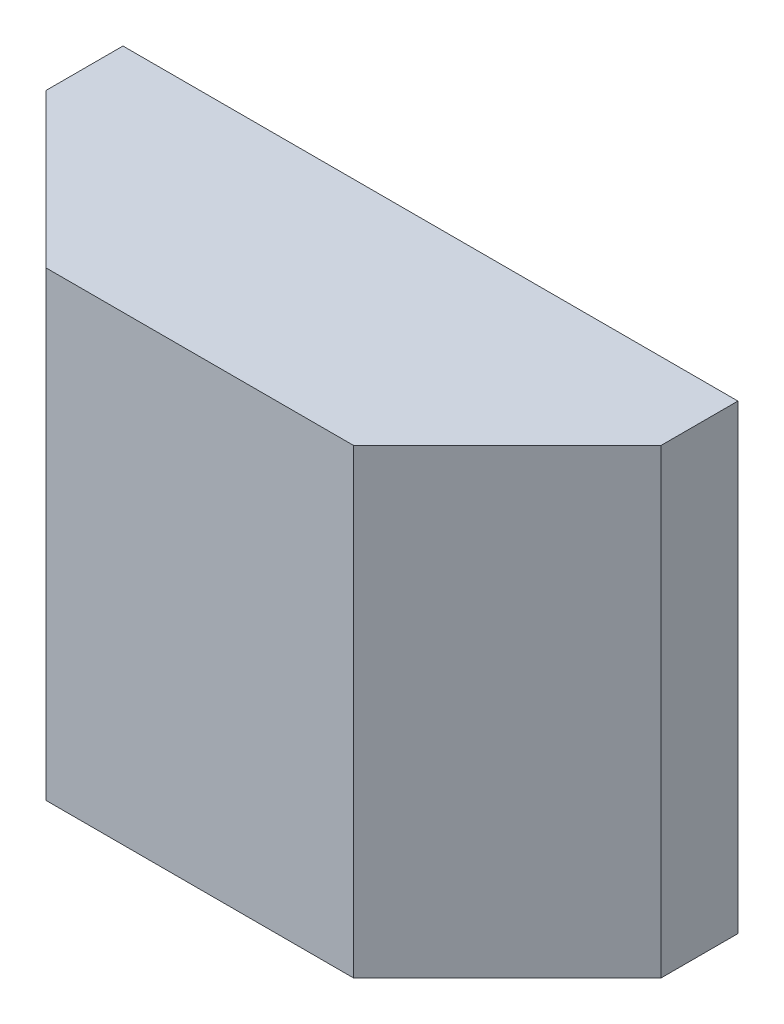
ISO-10303-21;
HEADER;
FILE_DESCRIPTION(('STEP AP214'),'2;1');
FILE_NAME('part.step','',(''),(''),'','','');
FILE_SCHEMA(('AUTOMOTIVE_DESIGN { 1 0 10303 214 1 1 1 1 }'));
ENDSEC;
DATA;
#1=APPLICATION_CONTEXT('core data for automotive mechanical design processes');
#2=APPLICATION_PROTOCOL_DEFINITION('international standard','automotive_design',2000,#1);
#3=PRODUCT_CONTEXT('',#1,'mechanical');
#4=PRODUCT('Part','Part','',(#3));
#5=PRODUCT_RELATED_PRODUCT_CATEGORY('part','',(#4));
#6=PRODUCT_DEFINITION_FORMATION('','',#4);
#7=PRODUCT_DEFINITION_CONTEXT('part definition',#1,'design');
#8=PRODUCT_DEFINITION('design','',#6,#7);
#9=PRODUCT_DEFINITION_SHAPE('','',#8);
#10=(LENGTH_UNIT() NAMED_UNIT(*) SI_UNIT(.MILLI.,.METRE.));
#11=(NAMED_UNIT(*) PLANE_ANGLE_UNIT() SI_UNIT($,.RADIAN.));
#12=(NAMED_UNIT(*) SI_UNIT($,.STERADIAN.) SOLID_ANGLE_UNIT());
#13=UNCERTAINTY_MEASURE_WITH_UNIT(LENGTH_MEASURE(1.E-05),#10,'distance_accuracy_value','');
#14=(GEOMETRIC_REPRESENTATION_CONTEXT(3) GLOBAL_UNCERTAINTY_ASSIGNED_CONTEXT((#13)) GLOBAL_UNIT_ASSIGNED_CONTEXT((#10,
#11,#12)) REPRESENTATION_CONTEXT('',''));
#15=CARTESIAN_POINT('',(0.,0.,0.));
#16=DIRECTION('',(0.,0.,1.));
#17=DIRECTION('',(1.,0.,0.));
#18=AXIS2_PLACEMENT_3D('',#15,#16,#17);
#19=CARTESIAN_POINT('',(2.,-1.5,1.5));
#20=DIRECTION('',(-1.,0.,0.));
#21=DIRECTION('',(0.,0.,1.));
#22=AXIS2_PLACEMENT_3D('',#19,#20,#21);
#23=PLANE('',#22);
#24=DIRECTION('',(0.,0.,-1.));
#25=VECTOR('',#24,1.);
#26=CARTESIAN_POINT('',(2.,1.5,1.5));
#27=LINE('',#26,#25);
#28=CARTESIAN_POINT('',(2.,1.5,0.499999999999996));
#29=VERTEX_POINT('',#28);
#30=CARTESIAN_POINT('',(2.,1.5,0.));
#31=VERTEX_POINT('',#30);
#32=EDGE_CURVE('E91',#29,#31,#27,.T.);
#33=ORIENTED_EDGE('',*,*,#32,.F.);
#34=DIRECTION('',(0.,-1.,0.));
#35=VECTOR('',#34,1.);
#36=CARTESIAN_POINT('',(2.,-1.5,0.499999999999996));
#37=LINE('',#36,#35);
#38=CARTESIAN_POINT('',(2.,-1.5,0.499999999999996));
#39=VERTEX_POINT('',#38);
#40=EDGE_CURVE('E62',#29,#39,#37,.T.);
#41=ORIENTED_EDGE('',*,*,#40,.T.);
#42=DIRECTION('',(0.,0.,-1.));
#43=VECTOR('',#42,1.);
#44=CARTESIAN_POINT('',(2.,-1.5,1.5));
#45=LINE('',#44,#43);
#46=CARTESIAN_POINT('',(2.,-1.5,0.));
#47=VERTEX_POINT('',#46);
#48=EDGE_CURVE('E111',#39,#47,#45,.T.);
#49=ORIENTED_EDGE('',*,*,#48,.T.);
#50=DIRECTION('',(0.,1.,0.));
#51=VECTOR('',#50,1.);
#52=CARTESIAN_POINT('',(2.,-1.5,0.));
#53=LINE('',#52,#51);
#54=EDGE_CURVE('E107',#47,#31,#53,.T.);
#55=ORIENTED_EDGE('',*,*,#54,.T.);
#56=EDGE_LOOP('',(#33,#41,#49,#55));
#57=FACE_BOUND('',#56,.T.);
#58=ADVANCED_FACE('F38',(#57),#23,.F.);
#59=CARTESIAN_POINT('',(-2.,1.5,1.5));
#60=DIRECTION('',(0.,-1.,0.));
#61=DIRECTION('',(0.,0.,-1.));
#62=AXIS2_PLACEMENT_3D('',#59,#60,#61);
#63=PLANE('',#62);
#64=DIRECTION('',(-1.,0.,0.));
#65=VECTOR('',#64,1.);
#66=CARTESIAN_POINT('',(-2.,1.5,1.5));
#67=LINE('',#66,#65);
#68=CARTESIAN_POINT('',(1.,1.5,1.5));
#69=VERTEX_POINT('',#68);
#70=CARTESIAN_POINT('',(-1.,1.5,1.5));
#71=VERTEX_POINT('',#70);
#72=EDGE_CURVE('E121',#69,#71,#67,.T.);
#73=ORIENTED_EDGE('',*,*,#72,.F.);
#74=DIRECTION('',(-0.707106781186546,0.,0.707106781186549));
#75=VECTOR('',#74,1.);
#76=CARTESIAN_POINT('',(1.,1.5,1.5));
#77=LINE('',#76,#75);
#78=EDGE_CURVE('E98',#69,#29,#77,.F.);
#79=ORIENTED_EDGE('',*,*,#78,.T.);
#80=ORIENTED_EDGE('',*,*,#32,.T.);
#81=DIRECTION('',(-1.,0.,0.));
#82=VECTOR('',#81,1.);
#83=CARTESIAN_POINT('',(-2.,1.5,0.));
#84=LINE('',#83,#82);
#85=CARTESIAN_POINT('',(-2.,1.5,0.));
#86=VERTEX_POINT('',#85);
#87=EDGE_CURVE('E96',#31,#86,#84,.T.);
#88=ORIENTED_EDGE('',*,*,#87,.T.);
#89=DIRECTION('',(0.,0.,-1.));
#90=VECTOR('',#89,1.);
#91=CARTESIAN_POINT('',(-2.,1.5,1.5));
#92=LINE('',#91,#90);
#93=CARTESIAN_POINT('',(-2.,1.5,0.499999999999996));
#94=VERTEX_POINT('',#93);
#95=EDGE_CURVE('E101',#94,#86,#92,.T.);
#96=ORIENTED_EDGE('',*,*,#95,.F.);
#97=DIRECTION('',(-0.707106781186546,0.,-0.707106781186549));
#98=VECTOR('',#97,1.);
#99=CARTESIAN_POINT('',(-1.,1.5,1.5));
#100=LINE('',#99,#98);
#101=EDGE_CURVE('E131',#94,#71,#100,.F.);
#102=ORIENTED_EDGE('',*,*,#101,.T.);
#103=EDGE_LOOP('',(#73,#79,#80,#88,#96,#102));
#104=FACE_BOUND('',#103,.T.);
#105=ADVANCED_FACE('F94',(#104),#63,.F.);
#106=CARTESIAN_POINT('',(-2.,-1.5,1.5));
#107=DIRECTION('',(1.,0.,0.));
#108=DIRECTION('',(0.,0.,-1.));
#109=AXIS2_PLACEMENT_3D('',#106,#107,#108);
#110=PLANE('',#109);
#111=DIRECTION('',(0.,0.,-1.));
#112=VECTOR('',#111,1.);
#113=CARTESIAN_POINT('',(-2.,-1.5,1.5));
#114=LINE('',#113,#112);
#115=CARTESIAN_POINT('',(-2.,-1.5,0.499999999999996));
#116=VERTEX_POINT('',#115);
#117=CARTESIAN_POINT('',(-2.,-1.5,0.));
#118=VERTEX_POINT('',#117);
#119=EDGE_CURVE('E123',#116,#118,#114,.T.);
#120=ORIENTED_EDGE('',*,*,#119,.F.);
#121=DIRECTION('',(0.,1.,0.));
#122=VECTOR('',#121,1.);
#123=CARTESIAN_POINT('',(-2.,-1.5,0.499999999999996));
#124=LINE('',#123,#122);
#125=EDGE_CURVE('E11',#116,#94,#124,.T.);
#126=ORIENTED_EDGE('',*,*,#125,.T.);
#127=ORIENTED_EDGE('',*,*,#95,.T.);
#128=DIRECTION('',(0.,-1.,0.));
#129=VECTOR('',#128,1.);
#130=CARTESIAN_POINT('',(-2.,-1.5,0.));
#131=LINE('',#130,#129);
#132=EDGE_CURVE('E109',#86,#118,#131,.T.);
#133=ORIENTED_EDGE('',*,*,#132,.T.);
#134=EDGE_LOOP('',(#120,#126,#127,#133));
#135=FACE_BOUND('',#134,.T.);
#136=ADVANCED_FACE('F158',(#135),#110,.F.);
#137=CARTESIAN_POINT('',(-2.,-1.5,1.5));
#138=DIRECTION('',(0.,1.,0.));
#139=DIRECTION('',(0.,0.,1.));
#140=AXIS2_PLACEMENT_3D('',#137,#138,#139);
#141=PLANE('',#140);
#142=ORIENTED_EDGE('',*,*,#48,.F.);
#143=DIRECTION('',(0.707106781186546,0.,-0.707106781186549));
#144=VECTOR('',#143,1.);
#145=CARTESIAN_POINT('',(1.,-1.5,1.5));
#146=LINE('',#145,#144);
#147=CARTESIAN_POINT('',(1.,-1.5,1.5));
#148=VERTEX_POINT('',#147);
#149=EDGE_CURVE('E47',#39,#148,#146,.F.);
#150=ORIENTED_EDGE('',*,*,#149,.T.);
#151=DIRECTION('',(1.,0.,0.));
#152=VECTOR('',#151,1.);
#153=CARTESIAN_POINT('',(-2.,-1.5,1.5));
#154=LINE('',#153,#152);
#155=CARTESIAN_POINT('',(-1.,-1.5,1.5));
#156=VERTEX_POINT('',#155);
#157=EDGE_CURVE('E115',#156,#148,#154,.T.);
#158=ORIENTED_EDGE('',*,*,#157,.F.);
#159=DIRECTION('',(0.707106781186546,0.,0.707106781186549));
#160=VECTOR('',#159,1.);
#161=CARTESIAN_POINT('',(-1.,-1.5,1.5));
#162=LINE('',#161,#160);
#163=EDGE_CURVE('E54',#156,#116,#162,.F.);
#164=ORIENTED_EDGE('',*,*,#163,.T.);
#165=ORIENTED_EDGE('',*,*,#119,.T.);
#166=DIRECTION('',(1.,0.,0.));
#167=VECTOR('',#166,1.);
#168=CARTESIAN_POINT('',(-2.,-1.5,0.));
#169=LINE('',#168,#167);
#170=EDGE_CURVE('E119',#118,#47,#169,.T.);
#171=ORIENTED_EDGE('',*,*,#170,.T.);
#172=EDGE_LOOP('',(#142,#150,#158,#164,#165,#171));
#173=FACE_BOUND('',#172,.T.);
#174=ADVANCED_FACE('F137',(#173),#141,.F.);
#175=CARTESIAN_POINT('',(0.,0.,1.5));
#176=DIRECTION('',(0.,0.,-1.));
#177=DIRECTION('',(-1.,0.,0.));
#178=AXIS2_PLACEMENT_3D('',#175,#176,#177);
#179=PLANE('',#178);
#180=ORIENTED_EDGE('',*,*,#157,.T.);
#181=DIRECTION('',(0.,1.,0.));
#182=VECTOR('',#181,1.);
#183=CARTESIAN_POINT('',(1.,0.,1.5));
#184=LINE('',#183,#182);
#185=EDGE_CURVE('E128',#148,#69,#184,.T.);
#186=ORIENTED_EDGE('',*,*,#185,.T.);
#187=ORIENTED_EDGE('',*,*,#72,.T.);
#188=DIRECTION('',(0.,-1.,0.));
#189=VECTOR('',#188,1.);
#190=CARTESIAN_POINT('',(-1.,0.,1.5));
#191=LINE('',#190,#189);
#192=EDGE_CURVE('E100',#71,#156,#191,.T.);
#193=ORIENTED_EDGE('',*,*,#192,.T.);
#194=EDGE_LOOP('',(#180,#186,#187,#193));
#195=FACE_BOUND('',#194,.T.);
#196=ADVANCED_FACE('F141',(#195),#179,.F.);
#197=CARTESIAN_POINT('',(0.,0.,0.));
#198=DIRECTION('',(0.,0.,-1.));
#199=DIRECTION('',(-1.,0.,0.));
#200=AXIS2_PLACEMENT_3D('',#197,#198,#199);
#201=PLANE('',#200);
#202=ORIENTED_EDGE('',*,*,#54,.F.);
#203=ORIENTED_EDGE('',*,*,#170,.F.);
#204=ORIENTED_EDGE('',*,*,#132,.F.);
#205=ORIENTED_EDGE('',*,*,#87,.F.);
#206=EDGE_LOOP('',(#202,#203,#204,#205));
#207=FACE_BOUND('',#206,.T.);
#208=ADVANCED_FACE('F105',(#207),#201,.T.);
#209=CARTESIAN_POINT('',(1.,0.,1.5));
#210=DIRECTION('',(-0.707106781186549,0.,-0.707106781186546));
#211=DIRECTION('',(0.,1.,0.));
#212=AXIS2_PLACEMENT_3D('',#209,#210,#211);
#213=PLANE('',#212);
#214=ORIENTED_EDGE('',*,*,#149,.F.);
#215=ORIENTED_EDGE('',*,*,#40,.F.);
#216=ORIENTED_EDGE('',*,*,#78,.F.);
#217=ORIENTED_EDGE('',*,*,#185,.F.);
#218=EDGE_LOOP('',(#214,#215,#216,#217));
#219=FACE_BOUND('',#218,.T.);
#220=ADVANCED_FACE('F144',(#219),#213,.F.);
#221=CARTESIAN_POINT('',(-1.,0.,1.5));
#222=DIRECTION('',(0.707106781186549,0.,-0.707106781186546));
#223=DIRECTION('',(0.,-1.,0.));
#224=AXIS2_PLACEMENT_3D('',#221,#222,#223);
#225=PLANE('',#224);
#226=ORIENTED_EDGE('',*,*,#101,.F.);
#227=ORIENTED_EDGE('',*,*,#125,.F.);
#228=ORIENTED_EDGE('',*,*,#163,.F.);
#229=ORIENTED_EDGE('',*,*,#192,.F.);
#230=EDGE_LOOP('',(#226,#227,#228,#229));
#231=FACE_BOUND('',#230,.T.);
#232=ADVANCED_FACE('F41',(#231),#225,.F.);
#233=CLOSED_SHELL('',(#58,#105,#136,#174,#196,#208,#220,#232));
#234=MANIFOLD_SOLID_BREP('B2',#233);
#235=ADVANCED_BREP_SHAPE_REPRESENTATION('',(#18,#234),#14);
#236=SHAPE_DEFINITION_REPRESENTATION(#9,#235);
ENDSEC;
END-ISO-10303-21;
